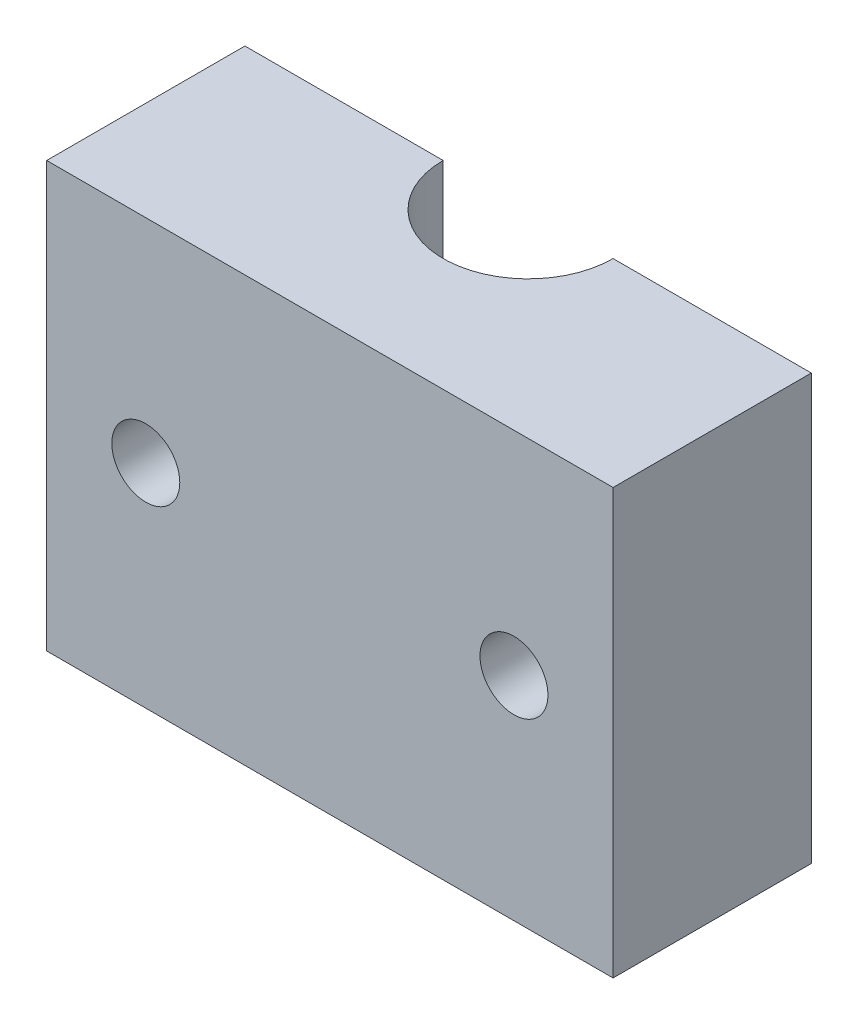
ISO-10303-21;
HEADER;
FILE_DESCRIPTION(('STEP AP214'),'2;1');
FILE_NAME('part.step','',(''),(''),'','','');
FILE_SCHEMA(('AUTOMOTIVE_DESIGN { 1 0 10303 214 1 1 1 1 }'));
ENDSEC;
DATA;
#1=APPLICATION_CONTEXT('core data for automotive mechanical design processes');
#2=APPLICATION_PROTOCOL_DEFINITION('international standard','automotive_design',2000,#1);
#3=PRODUCT_CONTEXT('',#1,'mechanical');
#4=PRODUCT('Part','Part','',(#3));
#5=PRODUCT_RELATED_PRODUCT_CATEGORY('part','',(#4));
#6=PRODUCT_DEFINITION_FORMATION('','',#4);
#7=PRODUCT_DEFINITION_CONTEXT('part definition',#1,'design');
#8=PRODUCT_DEFINITION('design','',#6,#7);
#9=PRODUCT_DEFINITION_SHAPE('','',#8);
#10=(LENGTH_UNIT() NAMED_UNIT(*) SI_UNIT(.MILLI.,.METRE.));
#11=(NAMED_UNIT(*) PLANE_ANGLE_UNIT() SI_UNIT($,.RADIAN.));
#12=(NAMED_UNIT(*) SI_UNIT($,.STERADIAN.) SOLID_ANGLE_UNIT());
#13=UNCERTAINTY_MEASURE_WITH_UNIT(LENGTH_MEASURE(1.E-05),#10,'distance_accuracy_value','');
#14=(GEOMETRIC_REPRESENTATION_CONTEXT(3) GLOBAL_UNCERTAINTY_ASSIGNED_CONTEXT((#13)) GLOBAL_UNIT_ASSIGNED_CONTEXT((#10,
#11,#12)) REPRESENTATION_CONTEXT('',''));
#15=CARTESIAN_POINT('',(0.,0.,0.));
#16=DIRECTION('',(0.,0.,1.));
#17=DIRECTION('',(1.,0.,0.));
#18=AXIS2_PLACEMENT_3D('',#15,#16,#17);
#19=CARTESIAN_POINT('',(-10.,-7.5,-3.5));
#20=DIRECTION('',(0.,0.,1.));
#21=DIRECTION('',(1.,0.,0.));
#22=AXIS2_PLACEMENT_3D('',#19,#20,#21);
#23=PLANE('',#22);
#24=CARTESIAN_POINT('',(6.5,0.,-3.5));
#25=DIRECTION('',(0.,0.,1.));
#26=DIRECTION('',(1.,0.,0.));
#27=AXIS2_PLACEMENT_3D('',#24,#25,#26);
#28=CIRCLE('',#27,1.2);
#29=CARTESIAN_POINT('',(7.7,0.,-3.5));
#30=VERTEX_POINT('',#29);
#31=EDGE_CURVE('E144',#30,#30,#28,.T.);
#32=ORIENTED_EDGE('',*,*,#31,.T.);
#33=EDGE_LOOP('',(#32));
#34=FACE_BOUND('',#33,.T.);
#35=DIRECTION('',(1.,0.,0.));
#36=VECTOR('',#35,1.);
#37=CARTESIAN_POINT('',(-10.,-7.5,-3.5));
#38=LINE('',#37,#36);
#39=CARTESIAN_POINT('',(3.,-7.5,-3.5));
#40=VERTEX_POINT('',#39);
#41=CARTESIAN_POINT('',(10.,-7.5,-3.5));
#42=VERTEX_POINT('',#41);
#43=EDGE_CURVE('E106',#40,#42,#38,.T.);
#44=ORIENTED_EDGE('',*,*,#43,.F.);
#45=DIRECTION('',(0.,1.,0.));
#46=VECTOR('',#45,1.);
#47=CARTESIAN_POINT('',(3.,-7.5,-3.5));
#48=LINE('',#47,#46);
#49=CARTESIAN_POINT('',(3.,7.5,-3.5));
#50=VERTEX_POINT('',#49);
#51=EDGE_CURVE('E11',#40,#50,#48,.T.);
#52=ORIENTED_EDGE('',*,*,#51,.T.);
#53=DIRECTION('',(-1.,0.,0.));
#54=VECTOR('',#53,1.);
#55=CARTESIAN_POINT('',(-10.,7.5,-3.5));
#56=LINE('',#55,#54);
#57=CARTESIAN_POINT('',(10.,7.5,-3.5));
#58=VERTEX_POINT('',#57);
#59=EDGE_CURVE('E105',#58,#50,#56,.T.);
#60=ORIENTED_EDGE('',*,*,#59,.F.);
#61=DIRECTION('',(0.,1.,0.));
#62=VECTOR('',#61,1.);
#63=CARTESIAN_POINT('',(10.,7.5,-3.5));
#64=LINE('',#63,#62);
#65=EDGE_CURVE('E114',#42,#58,#64,.T.);
#66=ORIENTED_EDGE('',*,*,#65,.F.);
#67=EDGE_LOOP('',(#44,#52,#60,#66));
#68=FACE_BOUND('',#67,.T.);
#69=ADVANCED_FACE('F36',(#34,#68),#23,.F.);
#70=CARTESIAN_POINT('',(-10.,7.5,3.5));
#71=DIRECTION('',(1.,0.,0.));
#72=DIRECTION('',(0.,1.,0.));
#73=AXIS2_PLACEMENT_3D('',#70,#71,#72);
#74=PLANE('',#73);
#75=DIRECTION('',(0.,-1.,0.));
#76=VECTOR('',#75,1.);
#77=CARTESIAN_POINT('',(-10.,7.5,-3.5));
#78=LINE('',#77,#76);
#79=CARTESIAN_POINT('',(-10.,7.5,-3.5));
#80=VERTEX_POINT('',#79);
#81=CARTESIAN_POINT('',(-10.,-7.5,-3.5));
#82=VERTEX_POINT('',#81);
#83=EDGE_CURVE('E133',#80,#82,#78,.T.);
#84=ORIENTED_EDGE('',*,*,#83,.T.);
#85=DIRECTION('',(0.,0.,-1.));
#86=VECTOR('',#85,1.);
#87=CARTESIAN_POINT('',(-10.,-7.5,3.5));
#88=LINE('',#87,#86);
#89=CARTESIAN_POINT('',(-10.,-7.5,3.5));
#90=VERTEX_POINT('',#89);
#91=EDGE_CURVE('E124',#90,#82,#88,.T.);
#92=ORIENTED_EDGE('',*,*,#91,.F.);
#93=DIRECTION('',(0.,-1.,0.));
#94=VECTOR('',#93,1.);
#95=CARTESIAN_POINT('',(-10.,7.5,3.5));
#96=LINE('',#95,#94);
#97=CARTESIAN_POINT('',(-10.,7.5,3.5));
#98=VERTEX_POINT('',#97);
#99=EDGE_CURVE('E111',#98,#90,#96,.T.);
#100=ORIENTED_EDGE('',*,*,#99,.F.);
#101=DIRECTION('',(0.,0.,-1.));
#102=VECTOR('',#101,1.);
#103=CARTESIAN_POINT('',(-10.,7.5,3.5));
#104=LINE('',#103,#102);
#105=EDGE_CURVE('E118',#98,#80,#104,.T.);
#106=ORIENTED_EDGE('',*,*,#105,.T.);
#107=EDGE_LOOP('',(#84,#92,#100,#106));
#108=FACE_BOUND('',#107,.T.);
#109=ADVANCED_FACE('F38',(#108),#74,.F.);
#110=CARTESIAN_POINT('',(-10.,-7.5,3.5));
#111=DIRECTION('',(0.,1.,0.));
#112=DIRECTION('',(0.,0.,1.));
#113=AXIS2_PLACEMENT_3D('',#110,#111,#112);
#114=PLANE('',#113);
#115=CARTESIAN_POINT('',(-3.,-7.5,-3.5));
#116=VERTEX_POINT('',#115);
#117=EDGE_CURVE('E129',#82,#116,#38,.T.);
#118=ORIENTED_EDGE('',*,*,#117,.T.);
#119=CARTESIAN_POINT('',(0.,-7.5,-3.5));
#120=DIRECTION('',(0.,1.,0.));
#121=DIRECTION('',(0.,0.,1.));
#122=AXIS2_PLACEMENT_3D('',#119,#120,#121);
#123=CIRCLE('',#122,3.);
#124=EDGE_CURVE('E51',#116,#40,#123,.T.);
#125=ORIENTED_EDGE('',*,*,#124,.T.);
#126=ORIENTED_EDGE('',*,*,#43,.T.);
#127=DIRECTION('',(0.,0.,-1.));
#128=VECTOR('',#127,1.);
#129=CARTESIAN_POINT('',(10.,-7.5,3.5));
#130=LINE('',#129,#128);
#131=CARTESIAN_POINT('',(10.,-7.5,3.5));
#132=VERTEX_POINT('',#131);
#133=EDGE_CURVE('E121',#132,#42,#130,.T.);
#134=ORIENTED_EDGE('',*,*,#133,.F.);
#135=DIRECTION('',(1.,0.,0.));
#136=VECTOR('',#135,1.);
#137=CARTESIAN_POINT('',(-10.,-7.5,3.5));
#138=LINE('',#137,#136);
#139=EDGE_CURVE('E89',#90,#132,#138,.T.);
#140=ORIENTED_EDGE('',*,*,#139,.F.);
#141=ORIENTED_EDGE('',*,*,#91,.T.);
#142=EDGE_LOOP('',(#118,#125,#126,#134,#140,#141));
#143=FACE_BOUND('',#142,.T.);
#144=ADVANCED_FACE('F130',(#143),#114,.F.);
#145=CARTESIAN_POINT('',(10.,7.5,3.5));
#146=DIRECTION('',(-1.,0.,0.));
#147=DIRECTION('',(0.,-1.,0.));
#148=AXIS2_PLACEMENT_3D('',#145,#146,#147);
#149=PLANE('',#148);
#150=ORIENTED_EDGE('',*,*,#65,.T.);
#151=DIRECTION('',(0.,0.,-1.));
#152=VECTOR('',#151,1.);
#153=CARTESIAN_POINT('',(10.,7.5,3.5));
#154=LINE('',#153,#152);
#155=CARTESIAN_POINT('',(10.,7.5,3.5));
#156=VERTEX_POINT('',#155);
#157=EDGE_CURVE('E110',#156,#58,#154,.T.);
#158=ORIENTED_EDGE('',*,*,#157,.F.);
#159=DIRECTION('',(0.,1.,0.));
#160=VECTOR('',#159,1.);
#161=CARTESIAN_POINT('',(10.,7.5,3.5));
#162=LINE('',#161,#160);
#163=EDGE_CURVE('E137',#132,#156,#162,.T.);
#164=ORIENTED_EDGE('',*,*,#163,.F.);
#165=ORIENTED_EDGE('',*,*,#133,.T.);
#166=EDGE_LOOP('',(#150,#158,#164,#165));
#167=FACE_BOUND('',#166,.T.);
#168=ADVANCED_FACE('F173',(#167),#149,.F.);
#169=CARTESIAN_POINT('',(-10.,7.5,3.5));
#170=DIRECTION('',(0.,-1.,0.));
#171=DIRECTION('',(0.,0.,-1.));
#172=AXIS2_PLACEMENT_3D('',#169,#170,#171);
#173=PLANE('',#172);
#174=ORIENTED_EDGE('',*,*,#59,.T.);
#175=CARTESIAN_POINT('',(0.,7.5,-3.5));
#176=DIRECTION('',(0.,1.,0.));
#177=DIRECTION('',(0.,0.,1.));
#178=AXIS2_PLACEMENT_3D('',#175,#176,#177);
#179=CIRCLE('',#178,3.);
#180=CARTESIAN_POINT('',(-3.,7.5,-3.5));
#181=VERTEX_POINT('',#180);
#182=EDGE_CURVE('E96',#181,#50,#179,.T.);
#183=ORIENTED_EDGE('',*,*,#182,.F.);
#184=EDGE_CURVE('E81',#181,#80,#56,.T.);
#185=ORIENTED_EDGE('',*,*,#184,.T.);
#186=ORIENTED_EDGE('',*,*,#105,.F.);
#187=DIRECTION('',(-1.,0.,0.));
#188=VECTOR('',#187,1.);
#189=CARTESIAN_POINT('',(-10.,7.5,3.5));
#190=LINE('',#189,#188);
#191=EDGE_CURVE('E60',#156,#98,#190,.T.);
#192=ORIENTED_EDGE('',*,*,#191,.F.);
#193=ORIENTED_EDGE('',*,*,#157,.T.);
#194=EDGE_LOOP('',(#174,#183,#185,#186,#192,#193));
#195=FACE_BOUND('',#194,.T.);
#196=ADVANCED_FACE('F108',(#195),#173,.F.);
#197=CARTESIAN_POINT('',(-10.,-7.5,3.5));
#198=DIRECTION('',(0.,0.,1.));
#199=DIRECTION('',(1.,0.,0.));
#200=AXIS2_PLACEMENT_3D('',#197,#198,#199);
#201=PLANE('',#200);
#202=CARTESIAN_POINT('',(6.5,0.,3.5));
#203=DIRECTION('',(0.,0.,1.));
#204=DIRECTION('',(1.,0.,0.));
#205=AXIS2_PLACEMENT_3D('',#202,#203,#204);
#206=CIRCLE('',#205,1.2);
#207=CARTESIAN_POINT('',(7.7,0.,3.5));
#208=VERTEX_POINT('',#207);
#209=EDGE_CURVE('E147',#208,#208,#206,.T.);
#210=ORIENTED_EDGE('',*,*,#209,.F.);
#211=EDGE_LOOP('',(#210));
#212=FACE_BOUND('',#211,.T.);
#213=CARTESIAN_POINT('',(-6.5,0.,3.5));
#214=DIRECTION('',(0.,0.,1.));
#215=DIRECTION('',(1.,0.,0.));
#216=AXIS2_PLACEMENT_3D('',#213,#214,#215);
#217=CIRCLE('',#216,1.2);
#218=CARTESIAN_POINT('',(-5.3,0.,3.5));
#219=VERTEX_POINT('',#218);
#220=EDGE_CURVE('E141',#219,#219,#217,.T.);
#221=ORIENTED_EDGE('',*,*,#220,.F.);
#222=EDGE_LOOP('',(#221));
#223=FACE_BOUND('',#222,.T.);
#224=ORIENTED_EDGE('',*,*,#99,.T.);
#225=ORIENTED_EDGE('',*,*,#139,.T.);
#226=ORIENTED_EDGE('',*,*,#163,.T.);
#227=ORIENTED_EDGE('',*,*,#191,.T.);
#228=EDGE_LOOP('',(#224,#225,#226,#227));
#229=FACE_BOUND('',#228,.T.);
#230=ADVANCED_FACE('F161',(#212,#223,#229),#201,.T.);
#231=CARTESIAN_POINT('',(-6.5,0.,-3.5));
#232=DIRECTION('',(0.,0.,1.));
#233=DIRECTION('',(1.,0.,0.));
#234=AXIS2_PLACEMENT_3D('',#231,#232,#233);
#235=CIRCLE('',#234,1.2);
#236=CARTESIAN_POINT('',(-5.3,0.,-3.5));
#237=VERTEX_POINT('',#236);
#238=EDGE_CURVE('E99',#237,#237,#235,.T.);
#239=ORIENTED_EDGE('',*,*,#238,.T.);
#240=EDGE_LOOP('',(#239));
#241=FACE_BOUND('',#240,.T.);
#242=ORIENTED_EDGE('',*,*,#184,.F.);
#243=DIRECTION('',(0.,1.,0.));
#244=VECTOR('',#243,1.);
#245=CARTESIAN_POINT('',(-3.,-7.5,-3.5));
#246=LINE('',#245,#244);
#247=EDGE_CURVE('E44',#181,#116,#246,.F.);
#248=ORIENTED_EDGE('',*,*,#247,.T.);
#249=ORIENTED_EDGE('',*,*,#117,.F.);
#250=ORIENTED_EDGE('',*,*,#83,.F.);
#251=EDGE_LOOP('',(#242,#248,#249,#250));
#252=FACE_BOUND('',#251,.T.);
#253=ADVANCED_FACE('F127',(#241,#252),#23,.F.);
#254=CARTESIAN_POINT('',(0.,-7.5,-3.5));
#255=DIRECTION('',(0.,1.,0.));
#256=DIRECTION('',(0.,0.,1.));
#257=AXIS2_PLACEMENT_3D('',#254,#255,#256);
#258=CYLINDRICAL_SURFACE('',#257,3.);
#259=ORIENTED_EDGE('',*,*,#124,.F.);
#260=ORIENTED_EDGE('',*,*,#247,.F.);
#261=ORIENTED_EDGE('',*,*,#182,.T.);
#262=ORIENTED_EDGE('',*,*,#51,.F.);
#263=EDGE_LOOP('',(#259,#260,#261,#262));
#264=FACE_BOUND('',#263,.T.);
#265=ADVANCED_FACE('F97',(#264),#258,.F.);
#266=CARTESIAN_POINT('',(-6.5,0.,-3.5));
#267=DIRECTION('',(0.,0.,1.));
#268=DIRECTION('',(1.,0.,0.));
#269=AXIS2_PLACEMENT_3D('',#266,#267,#268);
#270=CYLINDRICAL_SURFACE('',#269,1.2);
#271=ORIENTED_EDGE('',*,*,#238,.F.);
#272=EDGE_LOOP('',(#271));
#273=FACE_BOUND('',#272,.T.);
#274=ORIENTED_EDGE('',*,*,#220,.T.);
#275=EDGE_LOOP('',(#274));
#276=FACE_BOUND('',#275,.T.);
#277=ADVANCED_FACE('F157',(#273,#276),#270,.F.);
#278=CARTESIAN_POINT('',(6.5,0.,-3.5));
#279=DIRECTION('',(0.,0.,1.));
#280=DIRECTION('',(1.,0.,0.));
#281=AXIS2_PLACEMENT_3D('',#278,#279,#280);
#282=CYLINDRICAL_SURFACE('',#281,1.2);
#283=ORIENTED_EDGE('',*,*,#31,.F.);
#284=EDGE_LOOP('',(#283));
#285=FACE_BOUND('',#284,.T.);
#286=ORIENTED_EDGE('',*,*,#209,.T.);
#287=EDGE_LOOP('',(#286));
#288=FACE_BOUND('',#287,.T.);
#289=ADVANCED_FACE('F154',(#285,#288),#282,.F.);
#290=CLOSED_SHELL('',(#69,#109,#144,#168,#196,#230,#253,#265,#277,#289));
#291=MANIFOLD_SOLID_BREP('B2',#290);
#292=ADVANCED_BREP_SHAPE_REPRESENTATION('',(#18,#291),#14);
#293=SHAPE_DEFINITION_REPRESENTATION(#9,#292);
ENDSEC;
END-ISO-10303-21;
